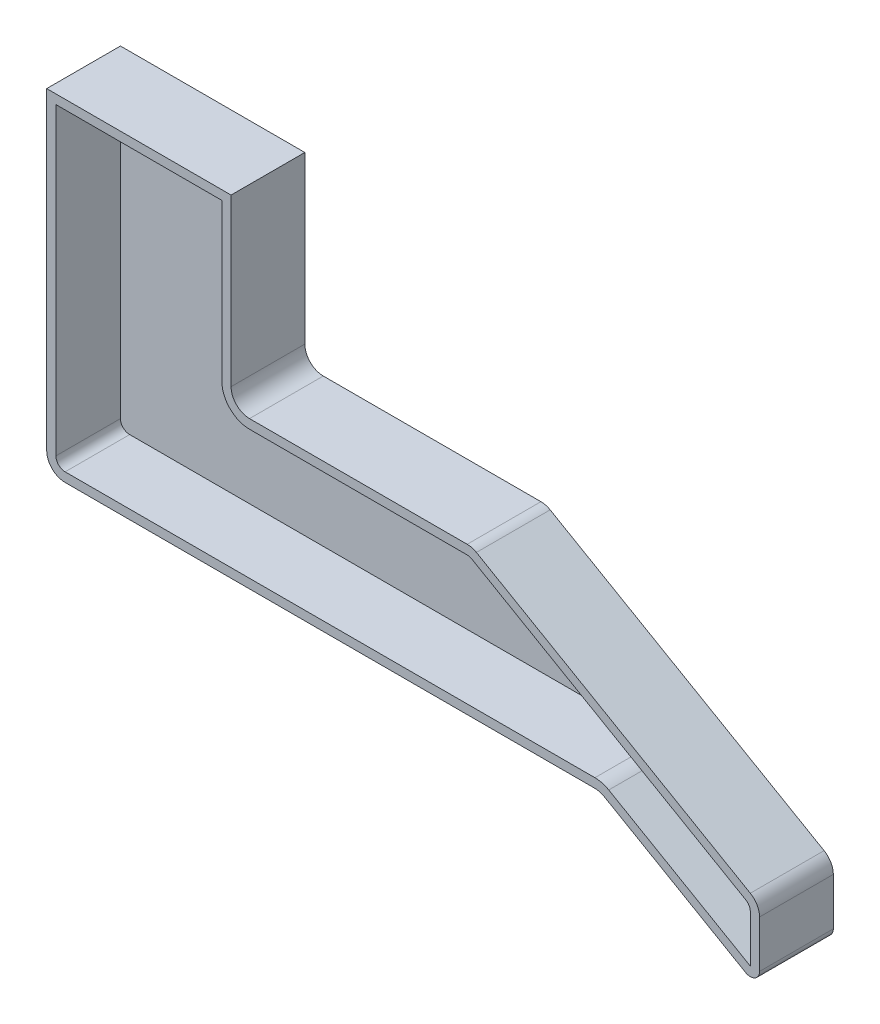
ISO-10303-21;
HEADER;
FILE_DESCRIPTION(('STEP AP214'),'2;1');
FILE_NAME('part.step','',(''),(''),'','','');
FILE_SCHEMA(('AUTOMOTIVE_DESIGN { 1 0 10303 214 1 1 1 1 }'));
ENDSEC;
DATA;
#1=APPLICATION_CONTEXT('core data for automotive mechanical design processes');
#2=APPLICATION_PROTOCOL_DEFINITION('international standard','automotive_design',2000,#1);
#3=PRODUCT_CONTEXT('',#1,'mechanical');
#4=PRODUCT('Part','Part','',(#3));
#5=PRODUCT_RELATED_PRODUCT_CATEGORY('part','',(#4));
#6=PRODUCT_DEFINITION_FORMATION('','',#4);
#7=PRODUCT_DEFINITION_CONTEXT('part definition',#1,'design');
#8=PRODUCT_DEFINITION('design','',#6,#7);
#9=PRODUCT_DEFINITION_SHAPE('','',#8);
#10=(LENGTH_UNIT() NAMED_UNIT(*) SI_UNIT(.MILLI.,.METRE.));
#11=(NAMED_UNIT(*) PLANE_ANGLE_UNIT() SI_UNIT($,.RADIAN.));
#12=(NAMED_UNIT(*) SI_UNIT($,.STERADIAN.) SOLID_ANGLE_UNIT());
#13=UNCERTAINTY_MEASURE_WITH_UNIT(LENGTH_MEASURE(1.E-05),#10,'distance_accuracy_value','');
#14=(GEOMETRIC_REPRESENTATION_CONTEXT(3) GLOBAL_UNCERTAINTY_ASSIGNED_CONTEXT((#13)) GLOBAL_UNIT_ASSIGNED_CONTEXT((#10,
#11,#12)) REPRESENTATION_CONTEXT('',''));
#15=CARTESIAN_POINT('',(0.,0.,0.));
#16=DIRECTION('',(0.,0.,1.));
#17=DIRECTION('',(1.,0.,0.));
#18=AXIS2_PLACEMENT_3D('',#15,#16,#17);
#19=CARTESIAN_POINT('',(0.,-231.820824471345,20.));
#20=DIRECTION('',(1.,0.,0.));
#21=DIRECTION('',(0.,1.,0.));
#22=AXIS2_PLACEMENT_3D('',#19,#20,#21);
#23=PLANE('',#22);
#24=DIRECTION('',(0.,-1.,0.));
#25=VECTOR('',#24,1.);
#26=CARTESIAN_POINT('',(0.,-231.820824471345,0.));
#27=LINE('',#26,#25);
#28=CARTESIAN_POINT('',(0.,0.,0.));
#29=VERTEX_POINT('',#28);
#30=CARTESIAN_POINT('',(0.,-85.,0.));
#31=VERTEX_POINT('',#30);
#32=EDGE_CURVE('E177',#29,#31,#27,.T.);
#33=ORIENTED_EDGE('',*,*,#32,.T.);
#34=DIRECTION('',(0.,0.,-1.));
#35=VECTOR('',#34,1.);
#36=CARTESIAN_POINT('',(0.,-85.,20.));
#37=LINE('',#36,#35);
#38=CARTESIAN_POINT('',(0.,-85.,20.));
#39=VERTEX_POINT('',#38);
#40=EDGE_CURVE('E11',#39,#31,#37,.T.);
#41=ORIENTED_EDGE('',*,*,#40,.F.);
#42=DIRECTION('',(0.,-1.,0.));
#43=VECTOR('',#42,1.);
#44=CARTESIAN_POINT('',(0.,-231.820824471345,20.));
#45=LINE('',#44,#43);
#46=CARTESIAN_POINT('',(0.,0.,20.));
#47=VERTEX_POINT('',#46);
#48=EDGE_CURVE('E212',#47,#39,#45,.T.);
#49=ORIENTED_EDGE('',*,*,#48,.F.);
#50=DIRECTION('',(0.,0.,-1.));
#51=VECTOR('',#50,1.);
#52=CARTESIAN_POINT('',(0.,0.,20.));
#53=LINE('',#52,#51);
#54=EDGE_CURVE('E55',#47,#29,#53,.T.);
#55=ORIENTED_EDGE('',*,*,#54,.T.);
#56=EDGE_LOOP('',(#33,#41,#49,#55));
#57=FACE_BOUND('',#56,.T.);
#58=ADVANCED_FACE('F32',(#57),#23,.F.);
#59=CARTESIAN_POINT('',(5.00000000000001,-85.,20.));
#60=DIRECTION('',(0.,0.,-1.));
#61=DIRECTION('',(-1.,0.,0.));
#62=AXIS2_PLACEMENT_3D('',#59,#60,#61);
#63=CYLINDRICAL_SURFACE('',#62,5.);
#64=CARTESIAN_POINT('',(5.00000000000001,-85.,0.));
#65=DIRECTION('',(0.,0.,1.));
#66=DIRECTION('',(1.,0.,0.));
#67=AXIS2_PLACEMENT_3D('',#64,#65,#66);
#68=CIRCLE('',#67,5.);
#69=CARTESIAN_POINT('',(5.00000000000002,-90.,0.));
#70=VERTEX_POINT('',#69);
#71=EDGE_CURVE('E179',#31,#70,#68,.T.);
#72=ORIENTED_EDGE('',*,*,#71,.T.);
#73=DIRECTION('',(0.,0.,-1.));
#74=VECTOR('',#73,1.);
#75=CARTESIAN_POINT('',(5.00000000000002,-90.,20.));
#76=LINE('',#75,#74);
#77=CARTESIAN_POINT('',(5.00000000000002,-90.,20.));
#78=VERTEX_POINT('',#77);
#79=EDGE_CURVE('E39',#78,#70,#76,.T.);
#80=ORIENTED_EDGE('',*,*,#79,.F.);
#81=CARTESIAN_POINT('',(5.00000000000001,-85.,20.));
#82=DIRECTION('',(0.,0.,1.));
#83=DIRECTION('',(1.,0.,0.));
#84=AXIS2_PLACEMENT_3D('',#81,#82,#83);
#85=CIRCLE('',#84,5.);
#86=EDGE_CURVE('E112',#39,#78,#85,.T.);
#87=ORIENTED_EDGE('',*,*,#86,.F.);
#88=ORIENTED_EDGE('',*,*,#40,.T.);
#89=EDGE_LOOP('',(#72,#80,#87,#88));
#90=FACE_BOUND('',#89,.T.);
#91=ADVANCED_FACE('F280',(#90),#63,.T.);
#92=CARTESIAN_POINT('',(97.1327483626984,-90.,20.));
#93=DIRECTION('',(0.,1.,0.));
#94=DIRECTION('',(0.,0.,1.));
#95=AXIS2_PLACEMENT_3D('',#92,#93,#94);
#96=PLANE('',#95);
#97=DIRECTION('',(1.,0.,0.));
#98=VECTOR('',#97,1.);
#99=CARTESIAN_POINT('',(97.1327483626984,-90.,0.));
#100=LINE('',#99,#98);
#101=CARTESIAN_POINT('',(148.660254037844,-90.,0.));
#102=VERTEX_POINT('',#101);
#103=EDGE_CURVE('E182',#70,#102,#100,.T.);
#104=ORIENTED_EDGE('',*,*,#103,.T.);
#105=DIRECTION('',(0.,0.,-1.));
#106=VECTOR('',#105,1.);
#107=CARTESIAN_POINT('',(148.660254037844,-90.,20.));
#108=LINE('',#107,#106);
#109=CARTESIAN_POINT('',(148.660254037844,-90.,20.));
#110=VERTEX_POINT('',#109);
#111=EDGE_CURVE('E232',#110,#102,#108,.T.);
#112=ORIENTED_EDGE('',*,*,#111,.F.);
#113=DIRECTION('',(1.,0.,0.));
#114=VECTOR('',#113,1.);
#115=CARTESIAN_POINT('',(97.1327483626984,-90.,20.));
#116=LINE('',#115,#114);
#117=EDGE_CURVE('E240',#78,#110,#116,.T.);
#118=ORIENTED_EDGE('',*,*,#117,.F.);
#119=ORIENTED_EDGE('',*,*,#79,.T.);
#120=EDGE_LOOP('',(#104,#112,#118,#119));
#121=FACE_BOUND('',#120,.T.);
#122=ADVANCED_FACE('F238',(#121),#96,.F.);
#123=CARTESIAN_POINT('',(148.660254037844,-95.,20.));
#124=DIRECTION('',(0.,0.,-1.));
#125=DIRECTION('',(-1.,0.,0.));
#126=AXIS2_PLACEMENT_3D('',#123,#124,#125);
#127=CYLINDRICAL_SURFACE('',#126,4.99999999999999);
#128=CARTESIAN_POINT('',(148.660254037844,-95.,0.));
#129=DIRECTION('',(0.,0.,1.));
#130=DIRECTION('',(1.,0.,0.));
#131=AXIS2_PLACEMENT_3D('',#128,#129,#130);
#132=CIRCLE('',#131,4.99999999999999);
#133=CARTESIAN_POINT('',(151.160254037844,-90.6698729810778,0.));
#134=VERTEX_POINT('',#133);
#135=EDGE_CURVE('E184',#102,#134,#132,.F.);
#136=ORIENTED_EDGE('',*,*,#135,.T.);
#137=DIRECTION('',(0.,0.,-1.));
#138=VECTOR('',#137,1.);
#139=CARTESIAN_POINT('',(151.160254037844,-90.6698729810778,20.));
#140=LINE('',#139,#138);
#141=CARTESIAN_POINT('',(151.160254037844,-90.6698729810778,20.));
#142=VERTEX_POINT('',#141);
#143=EDGE_CURVE('E229',#142,#134,#140,.T.);
#144=ORIENTED_EDGE('',*,*,#143,.F.);
#145=CARTESIAN_POINT('',(148.660254037844,-95.,20.));
#146=DIRECTION('',(0.,0.,1.));
#147=DIRECTION('',(1.,0.,0.));
#148=AXIS2_PLACEMENT_3D('',#145,#146,#147);
#149=CIRCLE('',#148,4.99999999999999);
#150=EDGE_CURVE('E257',#110,#142,#149,.F.);
#151=ORIENTED_EDGE('',*,*,#150,.F.);
#152=ORIENTED_EDGE('',*,*,#111,.T.);
#153=EDGE_LOOP('',(#136,#144,#151,#152));
#154=FACE_BOUND('',#153,.T.);
#155=ADVANCED_FACE('F248',(#154),#127,.F.);
#156=CARTESIAN_POINT('',(171.759779660943,-102.563014644752,20.));
#157=DIRECTION('',(0.500000000000001,0.866025403784438,0.));
#158=DIRECTION('',(-0.866025403784438,0.500000000000001,0.));
#159=AXIS2_PLACEMENT_3D('',#156,#157,#158);
#160=PLANE('',#159);
#161=DIRECTION('',(0.866025403784438,-0.500000000000001,0.));
#162=VECTOR('',#161,1.);
#163=CARTESIAN_POINT('',(171.759779660943,-102.563014644752,0.));
#164=LINE('',#163,#162);
#165=CARTESIAN_POINT('',(189.551270189222,-112.834936490539,0.));
#166=VERTEX_POINT('',#165);
#167=EDGE_CURVE('E186',#134,#166,#164,.T.);
#168=ORIENTED_EDGE('',*,*,#167,.T.);
#169=DIRECTION('',(0.,0.,-1.));
#170=VECTOR('',#169,1.);
#171=CARTESIAN_POINT('',(189.551270189222,-112.834936490539,20.));
#172=LINE('',#171,#170);
#173=CARTESIAN_POINT('',(189.551270189222,-112.834936490539,20.));
#174=VERTEX_POINT('',#173);
#175=EDGE_CURVE('E226',#174,#166,#172,.T.);
#176=ORIENTED_EDGE('',*,*,#175,.F.);
#177=DIRECTION('',(0.866025403784438,-0.500000000000001,0.));
#178=VECTOR('',#177,1.);
#179=CARTESIAN_POINT('',(171.759779660943,-102.563014644752,20.));
#180=LINE('',#179,#178);
#181=EDGE_CURVE('E254',#142,#174,#180,.T.);
#182=ORIENTED_EDGE('',*,*,#181,.F.);
#183=ORIENTED_EDGE('',*,*,#143,.T.);
#184=EDGE_LOOP('',(#168,#176,#182,#183));
#185=FACE_BOUND('',#184,.T.);
#186=ADVANCED_FACE('F252',(#185),#160,.F.);
#187=CARTESIAN_POINT('',(190.801270189222,-110.669872981078,20.));
#188=DIRECTION('',(0.,0.,-1.));
#189=DIRECTION('',(-1.,0.,0.));
#190=AXIS2_PLACEMENT_3D('',#187,#188,#189);
#191=CYLINDRICAL_SURFACE('',#190,2.49999999999998);
#192=CARTESIAN_POINT('',(190.801270189222,-110.669872981078,0.));
#193=DIRECTION('',(0.,0.,1.));
#194=DIRECTION('',(1.,0.,0.));
#195=AXIS2_PLACEMENT_3D('',#192,#193,#194);
#196=CIRCLE('',#195,2.49999999999998);
#197=CARTESIAN_POINT('',(193.301270189222,-110.669872981078,0.));
#198=VERTEX_POINT('',#197);
#199=EDGE_CURVE('E188',#166,#198,#196,.T.);
#200=ORIENTED_EDGE('',*,*,#199,.T.);
#201=DIRECTION('',(0.,0.,-1.));
#202=VECTOR('',#201,1.);
#203=CARTESIAN_POINT('',(193.301270189222,-110.669872981078,20.));
#204=LINE('',#203,#202);
#205=CARTESIAN_POINT('',(193.301270189222,-110.669872981078,20.));
#206=VERTEX_POINT('',#205);
#207=EDGE_CURVE('E224',#206,#198,#204,.T.);
#208=ORIENTED_EDGE('',*,*,#207,.F.);
#209=CARTESIAN_POINT('',(190.801270189222,-110.669872981078,20.));
#210=DIRECTION('',(0.,0.,1.));
#211=DIRECTION('',(1.,0.,0.));
#212=AXIS2_PLACEMENT_3D('',#209,#210,#211);
#213=CIRCLE('',#212,2.49999999999998);
#214=EDGE_CURVE('E256',#174,#206,#213,.T.);
#215=ORIENTED_EDGE('',*,*,#214,.F.);
#216=ORIENTED_EDGE('',*,*,#175,.T.);
#217=EDGE_LOOP('',(#200,#208,#215,#216));
#218=FACE_BOUND('',#217,.T.);
#219=ADVANCED_FACE('F292',(#218),#191,.T.);
#220=CARTESIAN_POINT('',(193.301270189222,-231.820824471345,20.));
#221=DIRECTION('',(1.,0.,0.));
#222=DIRECTION('',(0.,1.,0.));
#223=AXIS2_PLACEMENT_3D('',#220,#221,#222);
#224=PLANE('',#223);
#225=DIRECTION('',(0.,-1.,0.));
#226=VECTOR('',#225,1.);
#227=CARTESIAN_POINT('',(193.301270189222,-231.820824471345,0.));
#228=LINE('',#227,#226);
#229=CARTESIAN_POINT('',(193.301270189222,-97.8867513459482,0.));
#230=VERTEX_POINT('',#229);
#231=EDGE_CURVE('E191',#230,#198,#228,.T.);
#232=ORIENTED_EDGE('',*,*,#231,.F.);
#233=DIRECTION('',(0.,0.,-1.));
#234=VECTOR('',#233,1.);
#235=CARTESIAN_POINT('',(193.301270189222,-97.8867513459482,20.));
#236=LINE('',#235,#234);
#237=CARTESIAN_POINT('',(193.301270189222,-97.8867513459482,20.));
#238=VERTEX_POINT('',#237);
#239=EDGE_CURVE('E222',#238,#230,#236,.T.);
#240=ORIENTED_EDGE('',*,*,#239,.F.);
#241=DIRECTION('',(0.,-1.,0.));
#242=VECTOR('',#241,1.);
#243=CARTESIAN_POINT('',(193.301270189222,-231.820824471345,20.));
#244=LINE('',#243,#242);
#245=EDGE_CURVE('E259',#238,#206,#244,.T.);
#246=ORIENTED_EDGE('',*,*,#245,.T.);
#247=ORIENTED_EDGE('',*,*,#207,.T.);
#248=EDGE_LOOP('',(#232,#240,#246,#247));
#249=FACE_BOUND('',#248,.T.);
#250=ADVANCED_FACE('F295',(#249),#224,.T.);
#251=CARTESIAN_POINT('',(188.301270189222,-97.8867513459482,20.));
#252=DIRECTION('',(0.,0.,-1.));
#253=DIRECTION('',(-1.,0.,0.));
#254=AXIS2_PLACEMENT_3D('',#251,#252,#253);
#255=CYLINDRICAL_SURFACE('',#254,4.99999999999999);
#256=CARTESIAN_POINT('',(188.301270189222,-97.8867513459482,0.));
#257=DIRECTION('',(0.,0.,1.));
#258=DIRECTION('',(1.,0.,0.));
#259=AXIS2_PLACEMENT_3D('',#256,#257,#258);
#260=CIRCLE('',#259,4.99999999999999);
#261=CARTESIAN_POINT('',(190.801270189222,-93.556624327026,0.));
#262=VERTEX_POINT('',#261);
#263=EDGE_CURVE('E194',#262,#230,#260,.F.);
#264=ORIENTED_EDGE('',*,*,#263,.F.);
#265=DIRECTION('',(0.,0.,-1.));
#266=VECTOR('',#265,1.);
#267=CARTESIAN_POINT('',(190.801270189222,-93.556624327026,20.));
#268=LINE('',#267,#266);
#269=CARTESIAN_POINT('',(190.801270189222,-93.556624327026,20.));
#270=VERTEX_POINT('',#269);
#271=EDGE_CURVE('E220',#270,#262,#268,.T.);
#272=ORIENTED_EDGE('',*,*,#271,.F.);
#273=CARTESIAN_POINT('',(188.301270189222,-97.8867513459482,20.));
#274=DIRECTION('',(0.,0.,1.));
#275=DIRECTION('',(1.,0.,0.));
#276=AXIS2_PLACEMENT_3D('',#273,#274,#275);
#277=CIRCLE('',#276,4.99999999999999);
#278=EDGE_CURVE('E266',#270,#238,#277,.F.);
#279=ORIENTED_EDGE('',*,*,#278,.T.);
#280=ORIENTED_EDGE('',*,*,#239,.T.);
#281=EDGE_LOOP('',(#264,#272,#279,#280));
#282=FACE_BOUND('',#281,.T.);
#283=ADVANCED_FACE('F299',(#282),#255,.T.);
#284=CARTESIAN_POINT('',(180.420033698788,-87.5630146447526,20.));
#285=DIRECTION('',(-0.500000000000002,-0.866025403784438,0.));
#286=DIRECTION('',(0.866025403784438,-0.500000000000002,0.));
#287=AXIS2_PLACEMENT_3D('',#284,#285,#286);
#288=PLANE('',#287);
#289=DIRECTION('',(-0.866025403784438,0.500000000000002,0.));
#290=VECTOR('',#289,1.);
#291=CARTESIAN_POINT('',(180.420033698788,-87.5630146447526,0.));
#292=LINE('',#291,#290);
#293=CARTESIAN_POINT('',(116.519237886467,-50.6698729810778,0.));
#294=VERTEX_POINT('',#293);
#295=EDGE_CURVE('E197',#262,#294,#292,.T.);
#296=ORIENTED_EDGE('',*,*,#295,.T.);
#297=DIRECTION('',(0.,0.,-1.));
#298=VECTOR('',#297,1.);
#299=CARTESIAN_POINT('',(116.519237886467,-50.6698729810778,20.));
#300=LINE('',#299,#298);
#301=CARTESIAN_POINT('',(116.519237886467,-50.6698729810778,20.));
#302=VERTEX_POINT('',#301);
#303=EDGE_CURVE('E218',#302,#294,#300,.T.);
#304=ORIENTED_EDGE('',*,*,#303,.F.);
#305=DIRECTION('',(-0.866025403784438,0.500000000000002,0.));
#306=VECTOR('',#305,1.);
#307=CARTESIAN_POINT('',(180.420033698788,-87.5630146447526,20.));
#308=LINE('',#307,#306);
#309=EDGE_CURVE('E269',#270,#302,#308,.T.);
#310=ORIENTED_EDGE('',*,*,#309,.F.);
#311=ORIENTED_EDGE('',*,*,#271,.T.);
#312=EDGE_LOOP('',(#296,#304,#310,#311));
#313=FACE_BOUND('',#312,.T.);
#314=ADVANCED_FACE('F303',(#313),#288,.F.);
#315=CARTESIAN_POINT('',(114.019237886467,-55.,20.));
#316=DIRECTION('',(0.,0.,-1.));
#317=DIRECTION('',(-1.,0.,0.));
#318=AXIS2_PLACEMENT_3D('',#315,#316,#317);
#319=CYLINDRICAL_SURFACE('',#318,4.99999999999999);
#320=CARTESIAN_POINT('',(114.019237886467,-55.,0.));
#321=DIRECTION('',(0.,0.,1.));
#322=DIRECTION('',(1.,0.,0.));
#323=AXIS2_PLACEMENT_3D('',#320,#321,#322);
#324=CIRCLE('',#323,4.99999999999999);
#325=CARTESIAN_POINT('',(114.019237886467,-50.,0.));
#326=VERTEX_POINT('',#325);
#327=EDGE_CURVE('E200',#326,#294,#324,.F.);
#328=ORIENTED_EDGE('',*,*,#327,.F.);
#329=DIRECTION('',(0.,0.,-1.));
#330=VECTOR('',#329,1.);
#331=CARTESIAN_POINT('',(114.019237886467,-50.,20.));
#332=LINE('',#331,#330);
#333=CARTESIAN_POINT('',(114.019237886467,-50.,20.));
#334=VERTEX_POINT('',#333);
#335=EDGE_CURVE('E216',#334,#326,#332,.T.);
#336=ORIENTED_EDGE('',*,*,#335,.F.);
#337=CARTESIAN_POINT('',(114.019237886467,-55.,20.));
#338=DIRECTION('',(0.,0.,1.));
#339=DIRECTION('',(1.,0.,0.));
#340=AXIS2_PLACEMENT_3D('',#337,#338,#339);
#341=CIRCLE('',#340,4.99999999999999);
#342=EDGE_CURVE('E271',#334,#302,#341,.F.);
#343=ORIENTED_EDGE('',*,*,#342,.T.);
#344=ORIENTED_EDGE('',*,*,#303,.T.);
#345=EDGE_LOOP('',(#328,#336,#343,#344));
#346=FACE_BOUND('',#345,.T.);
#347=ADVANCED_FACE('F307',(#346),#319,.T.);
#348=CARTESIAN_POINT('',(97.1327483626983,-50.,20.));
#349=DIRECTION('',(0.,1.,0.));
#350=DIRECTION('',(-1.,0.,0.));
#351=AXIS2_PLACEMENT_3D('',#348,#349,#350);
#352=PLANE('',#351);
#353=DIRECTION('',(1.,0.,0.));
#354=VECTOR('',#353,1.);
#355=CARTESIAN_POINT('',(97.1327483626983,-50.,0.));
#356=LINE('',#355,#354);
#357=CARTESIAN_POINT('',(55.,-50.,0.));
#358=VERTEX_POINT('',#357);
#359=EDGE_CURVE('E203',#358,#326,#356,.T.);
#360=ORIENTED_EDGE('',*,*,#359,.F.);
#361=DIRECTION('',(0.,0.,-1.));
#362=VECTOR('',#361,1.);
#363=CARTESIAN_POINT('',(55.,-50.,20.));
#364=LINE('',#363,#362);
#365=CARTESIAN_POINT('',(55.,-50.,20.));
#366=VERTEX_POINT('',#365);
#367=EDGE_CURVE('E158',#366,#358,#364,.T.);
#368=ORIENTED_EDGE('',*,*,#367,.F.);
#369=DIRECTION('',(1.,0.,0.));
#370=VECTOR('',#369,1.);
#371=CARTESIAN_POINT('',(97.1327483626983,-50.,20.));
#372=LINE('',#371,#370);
#373=EDGE_CURVE('E169',#366,#334,#372,.T.);
#374=ORIENTED_EDGE('',*,*,#373,.T.);
#375=ORIENTED_EDGE('',*,*,#335,.T.);
#376=EDGE_LOOP('',(#360,#368,#374,#375));
#377=FACE_BOUND('',#376,.T.);
#378=ADVANCED_FACE('F275',(#377),#352,.T.);
#379=CARTESIAN_POINT('',(55.,-45.,20.));
#380=DIRECTION('',(0.,0.,-1.));
#381=DIRECTION('',(-1.,0.,0.));
#382=AXIS2_PLACEMENT_3D('',#379,#380,#381);
#383=CYLINDRICAL_SURFACE('',#382,5.);
#384=CARTESIAN_POINT('',(55.,-45.,0.));
#385=DIRECTION('',(0.,0.,1.));
#386=DIRECTION('',(1.,0.,0.));
#387=AXIS2_PLACEMENT_3D('',#384,#385,#386);
#388=CIRCLE('',#387,5.);
#389=CARTESIAN_POINT('',(50.,-45.,0.));
#390=VERTEX_POINT('',#389);
#391=EDGE_CURVE('E153',#390,#358,#388,.T.);
#392=ORIENTED_EDGE('',*,*,#391,.F.);
#393=DIRECTION('',(0.,0.,-1.));
#394=VECTOR('',#393,1.);
#395=CARTESIAN_POINT('',(50.,-45.,20.));
#396=LINE('',#395,#394);
#397=CARTESIAN_POINT('',(50.,-45.,20.));
#398=VERTEX_POINT('',#397);
#399=EDGE_CURVE('E148',#398,#390,#396,.T.);
#400=ORIENTED_EDGE('',*,*,#399,.F.);
#401=CARTESIAN_POINT('',(55.,-45.,20.));
#402=DIRECTION('',(0.,0.,1.));
#403=DIRECTION('',(1.,0.,0.));
#404=AXIS2_PLACEMENT_3D('',#401,#402,#403);
#405=CIRCLE('',#404,5.);
#406=EDGE_CURVE('E151',#398,#366,#405,.T.);
#407=ORIENTED_EDGE('',*,*,#406,.T.);
#408=ORIENTED_EDGE('',*,*,#367,.T.);
#409=EDGE_LOOP('',(#392,#400,#407,#408));
#410=FACE_BOUND('',#409,.T.);
#411=ADVANCED_FACE('F150',(#410),#383,.F.);
#412=CARTESIAN_POINT('',(50.,-231.820824471345,20.));
#413=DIRECTION('',(1.,0.,0.));
#414=DIRECTION('',(0.,0.,-1.));
#415=AXIS2_PLACEMENT_3D('',#412,#413,#414);
#416=PLANE('',#415);
#417=DIRECTION('',(0.,-1.,0.));
#418=VECTOR('',#417,1.);
#419=CARTESIAN_POINT('',(50.,-231.820824471345,0.));
#420=LINE('',#419,#418);
#421=CARTESIAN_POINT('',(50.,2.06698656436839E-13,0.));
#422=VERTEX_POINT('',#421);
#423=EDGE_CURVE('E207',#422,#390,#420,.T.);
#424=ORIENTED_EDGE('',*,*,#423,.F.);
#425=DIRECTION('',(0.,0.,-1.));
#426=VECTOR('',#425,1.);
#427=CARTESIAN_POINT('',(50.,2.06698656436839E-13,20.));
#428=LINE('',#427,#426);
#429=CARTESIAN_POINT('',(50.,2.06698656436839E-13,20.));
#430=VERTEX_POINT('',#429);
#431=EDGE_CURVE('E159',#430,#422,#428,.T.);
#432=ORIENTED_EDGE('',*,*,#431,.F.);
#433=DIRECTION('',(0.,-1.,0.));
#434=VECTOR('',#433,1.);
#435=CARTESIAN_POINT('',(50.,-231.820824471345,20.));
#436=LINE('',#435,#434);
#437=EDGE_CURVE('E166',#430,#398,#436,.T.);
#438=ORIENTED_EDGE('',*,*,#437,.T.);
#439=ORIENTED_EDGE('',*,*,#399,.T.);
#440=EDGE_LOOP('',(#424,#432,#438,#439));
#441=FACE_BOUND('',#440,.T.);
#442=ADVANCED_FACE('F171',(#441),#416,.T.);
#443=CARTESIAN_POINT('',(97.1327483626975,3.88578058618805E-13,20.));
#444=DIRECTION('',(0.,1.,0.));
#445=DIRECTION('',(-1.,0.,0.));
#446=AXIS2_PLACEMENT_3D('',#443,#444,#445);
#447=PLANE('',#446);
#448=DIRECTION('',(1.,0.,0.));
#449=VECTOR('',#448,1.);
#450=CARTESIAN_POINT('',(97.1327483626975,3.88578058618805E-13,0.));
#451=LINE('',#450,#449);
#452=EDGE_CURVE('E209',#29,#422,#451,.T.);
#453=ORIENTED_EDGE('',*,*,#452,.F.);
#454=ORIENTED_EDGE('',*,*,#54,.F.);
#455=DIRECTION('',(1.,0.,0.));
#456=VECTOR('',#455,1.);
#457=CARTESIAN_POINT('',(97.1327483626975,3.88578058618805E-13,20.));
#458=LINE('',#457,#456);
#459=EDGE_CURVE('E172',#47,#430,#458,.T.);
#460=ORIENTED_EDGE('',*,*,#459,.T.);
#461=ORIENTED_EDGE('',*,*,#431,.T.);
#462=EDGE_LOOP('',(#453,#454,#460,#461));
#463=FACE_BOUND('',#462,.T.);
#464=ADVANCED_FACE('F277',(#463),#447,.T.);
#465=CARTESIAN_POINT('',(97.1327483626984,-231.820824471345,20.));
#466=DIRECTION('',(0.,0.,1.));
#467=DIRECTION('',(1.,0.,0.));
#468=AXIS2_PLACEMENT_3D('',#465,#466,#467);
#469=PLANE('',#468);
#470=DIRECTION('',(0.,-1.,0.));
#471=VECTOR('',#470,1.);
#472=CARTESIAN_POINT('',(2.50000000000003,-231.820824471345,20.));
#473=LINE('',#472,#471);
#474=CARTESIAN_POINT('',(2.5,-2.49999999999998,20.));
#475=VERTEX_POINT('',#474);
#476=CARTESIAN_POINT('',(2.50000000000001,-85.,20.));
#477=VERTEX_POINT('',#476);
#478=EDGE_CURVE('E483',#475,#477,#473,.T.);
#479=ORIENTED_EDGE('',*,*,#478,.F.);
#480=DIRECTION('',(1.,0.,0.));
#481=VECTOR('',#480,1.);
#482=CARTESIAN_POINT('',(97.1327483626975,-2.49999999999961,20.));
#483=LINE('',#482,#481);
#484=CARTESIAN_POINT('',(47.5,-2.4999999999998,20.));
#485=VERTEX_POINT('',#484);
#486=EDGE_CURVE('E417',#475,#485,#483,.T.);
#487=ORIENTED_EDGE('',*,*,#486,.T.);
#488=DIRECTION('',(0.,-1.,0.));
#489=VECTOR('',#488,1.);
#490=CARTESIAN_POINT('',(47.5,-231.820824471345,20.));
#491=LINE('',#490,#489);
#492=CARTESIAN_POINT('',(47.5,-45.,20.));
#493=VERTEX_POINT('',#492);
#494=EDGE_CURVE('E46',#485,#493,#491,.T.);
#495=ORIENTED_EDGE('',*,*,#494,.T.);
#496=CARTESIAN_POINT('',(55.,-45.,20.));
#497=DIRECTION('',(0.,0.,1.));
#498=DIRECTION('',(1.,0.,0.));
#499=AXIS2_PLACEMENT_3D('',#496,#497,#498);
#500=CIRCLE('',#499,7.5);
#501=CARTESIAN_POINT('',(55.,-52.5,20.));
#502=VERTEX_POINT('',#501);
#503=EDGE_CURVE('E513',#493,#502,#500,.T.);
#504=ORIENTED_EDGE('',*,*,#503,.T.);
#505=DIRECTION('',(1.,0.,0.));
#506=VECTOR('',#505,1.);
#507=CARTESIAN_POINT('',(97.1327483626983,-52.5,20.));
#508=LINE('',#507,#506);
#509=CARTESIAN_POINT('',(114.019237886467,-52.5,20.));
#510=VERTEX_POINT('',#509);
#511=EDGE_CURVE('E510',#502,#510,#508,.T.);
#512=ORIENTED_EDGE('',*,*,#511,.T.);
#513=CARTESIAN_POINT('',(114.019237886467,-55.,20.));
#514=DIRECTION('',(0.,0.,1.));
#515=DIRECTION('',(1.,0.,0.));
#516=AXIS2_PLACEMENT_3D('',#513,#514,#515);
#517=CIRCLE('',#516,2.49999999999999);
#518=CARTESIAN_POINT('',(115.269237886467,-52.8349364905389,20.));
#519=VERTEX_POINT('',#518);
#520=EDGE_CURVE('E507',#510,#519,#517,.F.);
#521=ORIENTED_EDGE('',*,*,#520,.T.);
#522=DIRECTION('',(-0.866025403784438,0.500000000000002,0.));
#523=VECTOR('',#522,1.);
#524=CARTESIAN_POINT('',(179.170033698788,-89.7280781542137,20.));
#525=LINE('',#524,#523);
#526=CARTESIAN_POINT('',(189.551270189222,-95.7216878364871,20.));
#527=VERTEX_POINT('',#526);
#528=EDGE_CURVE('E504',#527,#519,#525,.T.);
#529=ORIENTED_EDGE('',*,*,#528,.F.);
#530=CARTESIAN_POINT('',(188.301270189222,-97.8867513459482,20.));
#531=DIRECTION('',(0.,0.,1.));
#532=DIRECTION('',(1.,0.,0.));
#533=AXIS2_PLACEMENT_3D('',#530,#531,#532);
#534=CIRCLE('',#533,2.49999999999999);
#535=CARTESIAN_POINT('',(190.801270189222,-97.8867513459482,20.));
#536=VERTEX_POINT('',#535);
#537=EDGE_CURVE('E501',#527,#536,#534,.F.);
#538=ORIENTED_EDGE('',*,*,#537,.T.);
#539=DIRECTION('',(0.,-1.,0.));
#540=VECTOR('',#539,1.);
#541=CARTESIAN_POINT('',(190.801270189222,-231.820824471345,20.));
#542=LINE('',#541,#540);
#543=CARTESIAN_POINT('',(190.801270189222,-110.669872981078,20.));
#544=VERTEX_POINT('',#543);
#545=EDGE_CURVE('E498',#536,#544,#542,.T.);
#546=ORIENTED_EDGE('',*,*,#545,.T.);
#547=DIRECTION('',(0.866025403784438,-0.500000000000001,0.));
#548=VECTOR('',#547,1.);
#549=CARTESIAN_POINT('',(173.009779660943,-100.397951135291,20.));
#550=LINE('',#549,#548);
#551=CARTESIAN_POINT('',(152.410254037844,-88.5048094716167,20.));
#552=VERTEX_POINT('',#551);
#553=EDGE_CURVE('E495',#552,#544,#550,.T.);
#554=ORIENTED_EDGE('',*,*,#553,.F.);
#555=CARTESIAN_POINT('',(148.660254037844,-95.,20.));
#556=DIRECTION('',(0.,0.,1.));
#557=DIRECTION('',(1.,0.,0.));
#558=AXIS2_PLACEMENT_3D('',#555,#556,#557);
#559=CIRCLE('',#558,7.49999999999999);
#560=CARTESIAN_POINT('',(148.660254037844,-87.5,20.));
#561=VERTEX_POINT('',#560);
#562=EDGE_CURVE('E492',#561,#552,#559,.F.);
#563=ORIENTED_EDGE('',*,*,#562,.F.);
#564=DIRECTION('',(1.,0.,0.));
#565=VECTOR('',#564,1.);
#566=CARTESIAN_POINT('',(97.1327483626984,-87.5,20.));
#567=LINE('',#566,#565);
#568=CARTESIAN_POINT('',(5.00000000000002,-87.5,20.));
#569=VERTEX_POINT('',#568);
#570=EDGE_CURVE('E489',#569,#561,#567,.T.);
#571=ORIENTED_EDGE('',*,*,#570,.F.);
#572=CARTESIAN_POINT('',(5.00000000000001,-85.,20.));
#573=DIRECTION('',(0.,0.,1.));
#574=DIRECTION('',(1.,0.,0.));
#575=AXIS2_PLACEMENT_3D('',#572,#573,#574);
#576=CIRCLE('',#575,2.5);
#577=EDGE_CURVE('E486',#477,#569,#576,.T.);
#578=ORIENTED_EDGE('',*,*,#577,.F.);
#579=EDGE_LOOP('',(#479,#487,#495,#504,#512,#521,#529,#538,#546,#554,#563,#571,#578));
#580=FACE_BOUND('',#579,.T.);
#581=ORIENTED_EDGE('',*,*,#48,.T.);
#582=ORIENTED_EDGE('',*,*,#86,.T.);
#583=ORIENTED_EDGE('',*,*,#117,.T.);
#584=ORIENTED_EDGE('',*,*,#150,.T.);
#585=ORIENTED_EDGE('',*,*,#181,.T.);
#586=ORIENTED_EDGE('',*,*,#214,.T.);
#587=ORIENTED_EDGE('',*,*,#245,.F.);
#588=ORIENTED_EDGE('',*,*,#278,.F.);
#589=ORIENTED_EDGE('',*,*,#309,.T.);
#590=ORIENTED_EDGE('',*,*,#342,.F.);
#591=ORIENTED_EDGE('',*,*,#373,.F.);
#592=ORIENTED_EDGE('',*,*,#406,.F.);
#593=ORIENTED_EDGE('',*,*,#437,.F.);
#594=ORIENTED_EDGE('',*,*,#459,.F.);
#595=EDGE_LOOP('',(#581,#582,#583,#584,#585,#586,#587,#588,#589,#590,#591,#592,#593,#594));
#596=FACE_BOUND('',#595,.T.);
#597=ADVANCED_FACE('F164',(#580,#596),#469,.T.);
#598=CARTESIAN_POINT('',(97.1327483626984,-231.820824471345,0.));
#599=DIRECTION('',(0.,0.,1.));
#600=DIRECTION('',(1.,0.,0.));
#601=AXIS2_PLACEMENT_3D('',#598,#599,#600);
#602=PLANE('',#601);
#603=CARTESIAN_POINT('',(35.,-10.,0.));
#604=DIRECTION('',(0.,0.,1.));
#605=DIRECTION('',(1.,0.,0.));
#606=AXIS2_PLACEMENT_3D('',#603,#604,#605);
#607=CIRCLE('',#606,2.5);
#608=CARTESIAN_POINT('',(37.5,-10.,0.));
#609=VERTEX_POINT('',#608);
#610=EDGE_CURVE('E393',#609,#609,#607,.T.);
#611=ORIENTED_EDGE('',*,*,#610,.T.);
#612=EDGE_LOOP('',(#611));
#613=FACE_BOUND('',#612,.T.);
#614=CARTESIAN_POINT('',(15.,-10.,0.));
#615=DIRECTION('',(0.,0.,1.));
#616=DIRECTION('',(1.,0.,0.));
#617=AXIS2_PLACEMENT_3D('',#614,#615,#616);
#618=CIRCLE('',#617,2.5);
#619=CARTESIAN_POINT('',(17.5,-10.,0.));
#620=VERTEX_POINT('',#619);
#621=EDGE_CURVE('E401',#620,#620,#618,.T.);
#622=ORIENTED_EDGE('',*,*,#621,.T.);
#623=EDGE_LOOP('',(#622));
#624=FACE_BOUND('',#623,.T.);
#625=ORIENTED_EDGE('',*,*,#32,.F.);
#626=ORIENTED_EDGE('',*,*,#452,.T.);
#627=ORIENTED_EDGE('',*,*,#423,.T.);
#628=ORIENTED_EDGE('',*,*,#391,.T.);
#629=ORIENTED_EDGE('',*,*,#359,.T.);
#630=ORIENTED_EDGE('',*,*,#327,.T.);
#631=ORIENTED_EDGE('',*,*,#295,.F.);
#632=ORIENTED_EDGE('',*,*,#263,.T.);
#633=ORIENTED_EDGE('',*,*,#231,.T.);
#634=ORIENTED_EDGE('',*,*,#199,.F.);
#635=ORIENTED_EDGE('',*,*,#167,.F.);
#636=ORIENTED_EDGE('',*,*,#135,.F.);
#637=ORIENTED_EDGE('',*,*,#103,.F.);
#638=ORIENTED_EDGE('',*,*,#71,.F.);
#639=EDGE_LOOP('',(#625,#626,#627,#628,#629,#630,#631,#632,#633,#634,#635,#636,#637,#638));
#640=FACE_BOUND('',#639,.T.);
#641=ADVANCED_FACE('F243',(#613,#624,#640),#602,.F.);
#642=CARTESIAN_POINT('',(2.50000000000003,-231.820824471345,20.));
#643=DIRECTION('',(1.,0.,0.));
#644=DIRECTION('',(0.,1.,0.));
#645=AXIS2_PLACEMENT_3D('',#642,#643,#644);
#646=PLANE('',#645);
#647=DIRECTION('',(0.,-1.,0.));
#648=VECTOR('',#647,1.);
#649=CARTESIAN_POINT('',(2.50000000000003,-231.820824471345,2.5));
#650=LINE('',#649,#648);
#651=CARTESIAN_POINT('',(2.5,-2.49999999999998,2.5));
#652=VERTEX_POINT('',#651);
#653=CARTESIAN_POINT('',(2.50000000000001,-85.,2.5));
#654=VERTEX_POINT('',#653);
#655=EDGE_CURVE('E404',#652,#654,#650,.T.);
#656=ORIENTED_EDGE('',*,*,#655,.F.);
#657=DIRECTION('',(0.,0.,-1.));
#658=VECTOR('',#657,1.);
#659=CARTESIAN_POINT('',(2.5,-2.49999999999998,20.));
#660=LINE('',#659,#658);
#661=EDGE_CURVE('E413',#475,#652,#660,.T.);
#662=ORIENTED_EDGE('',*,*,#661,.F.);
#663=ORIENTED_EDGE('',*,*,#478,.T.);
#664=DIRECTION('',(0.,0.,-1.));
#665=VECTOR('',#664,1.);
#666=CARTESIAN_POINT('',(2.50000000000001,-85.,20.));
#667=LINE('',#666,#665);
#668=EDGE_CURVE('E180',#477,#654,#667,.T.);
#669=ORIENTED_EDGE('',*,*,#668,.T.);
#670=EDGE_LOOP('',(#656,#662,#663,#669));
#671=FACE_BOUND('',#670,.T.);
#672=ADVANCED_FACE('F322',(#671),#646,.T.);
#673=CARTESIAN_POINT('',(5.00000000000001,-85.,20.));
#674=DIRECTION('',(0.,0.,-1.));
#675=DIRECTION('',(-1.,0.,0.));
#676=AXIS2_PLACEMENT_3D('',#673,#674,#675);
#677=CYLINDRICAL_SURFACE('',#676,2.5);
#678=CARTESIAN_POINT('',(5.00000000000001,-85.,2.5));
#679=DIRECTION('',(0.,0.,1.));
#680=DIRECTION('',(1.,0.,0.));
#681=AXIS2_PLACEMENT_3D('',#678,#679,#680);
#682=CIRCLE('',#681,2.5);
#683=CARTESIAN_POINT('',(5.00000000000002,-87.5,2.5));
#684=VERTEX_POINT('',#683);
#685=EDGE_CURVE('E409',#654,#684,#682,.T.);
#686=ORIENTED_EDGE('',*,*,#685,.F.);
#687=ORIENTED_EDGE('',*,*,#668,.F.);
#688=ORIENTED_EDGE('',*,*,#577,.T.);
#689=DIRECTION('',(0.,0.,1.));
#690=VECTOR('',#689,1.);
#691=CARTESIAN_POINT('',(5.00000000000002,-87.5,20.));
#692=LINE('',#691,#690);
#693=EDGE_CURVE('E412',#569,#684,#692,.F.);
#694=ORIENTED_EDGE('',*,*,#693,.T.);
#695=EDGE_LOOP('',(#686,#687,#688,#694));
#696=FACE_BOUND('',#695,.T.);
#697=ADVANCED_FACE('F374',(#696),#677,.F.);
#698=CARTESIAN_POINT('',(97.1327483626984,-87.5,20.));
#699=DIRECTION('',(0.,1.,0.));
#700=DIRECTION('',(0.,0.,1.));
#701=AXIS2_PLACEMENT_3D('',#698,#699,#700);
#702=PLANE('',#701);
#703=DIRECTION('',(1.,0.,0.));
#704=VECTOR('',#703,1.);
#705=CARTESIAN_POINT('',(97.1327483626984,-87.5,2.5));
#706=LINE('',#705,#704);
#707=CARTESIAN_POINT('',(148.660254037844,-87.5,2.5));
#708=VERTEX_POINT('',#707);
#709=EDGE_CURVE('E420',#684,#708,#706,.T.);
#710=ORIENTED_EDGE('',*,*,#709,.F.);
#711=ORIENTED_EDGE('',*,*,#693,.F.);
#712=ORIENTED_EDGE('',*,*,#570,.T.);
#713=DIRECTION('',(0.,0.,-1.));
#714=VECTOR('',#713,1.);
#715=CARTESIAN_POINT('',(148.660254037844,-87.5,20.));
#716=LINE('',#715,#714);
#717=EDGE_CURVE('E423',#561,#708,#716,.T.);
#718=ORIENTED_EDGE('',*,*,#717,.T.);
#719=EDGE_LOOP('',(#710,#711,#712,#718));
#720=FACE_BOUND('',#719,.T.);
#721=ADVANCED_FACE('F370',(#720),#702,.T.);
#722=CARTESIAN_POINT('',(148.660254037844,-95.,20.));
#723=DIRECTION('',(0.,0.,-1.));
#724=DIRECTION('',(-1.,0.,0.));
#725=AXIS2_PLACEMENT_3D('',#722,#723,#724);
#726=CYLINDRICAL_SURFACE('',#725,7.49999999999999);
#727=CARTESIAN_POINT('',(148.660254037844,-95.,2.5));
#728=DIRECTION('',(0.,0.,1.));
#729=DIRECTION('',(1.,0.,0.));
#730=AXIS2_PLACEMENT_3D('',#727,#728,#729);
#731=CIRCLE('',#730,7.49999999999999);
#732=CARTESIAN_POINT('',(152.410254037844,-88.5048094716167,2.5));
#733=VERTEX_POINT('',#732);
#734=EDGE_CURVE('E426',#708,#733,#731,.F.);
#735=ORIENTED_EDGE('',*,*,#734,.F.);
#736=ORIENTED_EDGE('',*,*,#717,.F.);
#737=ORIENTED_EDGE('',*,*,#562,.T.);
#738=DIRECTION('',(0.,0.,1.));
#739=VECTOR('',#738,1.);
#740=CARTESIAN_POINT('',(152.410254037844,-88.5048094716167,20.));
#741=LINE('',#740,#739);
#742=EDGE_CURVE('E429',#552,#733,#741,.F.);
#743=ORIENTED_EDGE('',*,*,#742,.T.);
#744=EDGE_LOOP('',(#735,#736,#737,#743));
#745=FACE_BOUND('',#744,.T.);
#746=ADVANCED_FACE('F366',(#745),#726,.T.);
#747=CARTESIAN_POINT('',(173.009779660943,-100.397951135291,20.));
#748=DIRECTION('',(0.500000000000001,0.866025403784438,0.));
#749=DIRECTION('',(-0.866025403784438,0.500000000000001,0.));
#750=AXIS2_PLACEMENT_3D('',#747,#748,#749);
#751=PLANE('',#750);
#752=DIRECTION('',(0.866025403784438,-0.500000000000001,0.));
#753=VECTOR('',#752,1.);
#754=CARTESIAN_POINT('',(173.009779660943,-100.397951135291,2.5));
#755=LINE('',#754,#753);
#756=CARTESIAN_POINT('',(190.801270189222,-110.669872981078,2.5));
#757=VERTEX_POINT('',#756);
#758=EDGE_CURVE('E432',#733,#757,#755,.T.);
#759=ORIENTED_EDGE('',*,*,#758,.F.);
#760=ORIENTED_EDGE('',*,*,#742,.F.);
#761=ORIENTED_EDGE('',*,*,#553,.T.);
#762=DIRECTION('',(0.,0.,-1.));
#763=VECTOR('',#762,1.);
#764=CARTESIAN_POINT('',(190.801270189222,-110.669872981078,20.));
#765=LINE('',#764,#763);
#766=EDGE_CURVE('E435',#544,#757,#765,.T.);
#767=ORIENTED_EDGE('',*,*,#766,.T.);
#768=EDGE_LOOP('',(#759,#760,#761,#767));
#769=FACE_BOUND('',#768,.T.);
#770=ADVANCED_FACE('F362',(#769),#751,.T.);
#771=CARTESIAN_POINT('',(190.801270189222,-231.820824471345,20.));
#772=DIRECTION('',(1.,0.,0.));
#773=DIRECTION('',(0.,1.,0.));
#774=AXIS2_PLACEMENT_3D('',#771,#772,#773);
#775=PLANE('',#774);
#776=DIRECTION('',(0.,-1.,0.));
#777=VECTOR('',#776,1.);
#778=CARTESIAN_POINT('',(190.801270189222,-231.820824471345,2.5));
#779=LINE('',#778,#777);
#780=CARTESIAN_POINT('',(190.801270189222,-97.8867513459482,2.5));
#781=VERTEX_POINT('',#780);
#782=EDGE_CURVE('E438',#781,#757,#779,.T.);
#783=ORIENTED_EDGE('',*,*,#782,.T.);
#784=ORIENTED_EDGE('',*,*,#766,.F.);
#785=ORIENTED_EDGE('',*,*,#545,.F.);
#786=DIRECTION('',(0.,0.,-1.));
#787=VECTOR('',#786,1.);
#788=CARTESIAN_POINT('',(190.801270189222,-97.8867513459482,20.));
#789=LINE('',#788,#787);
#790=EDGE_CURVE('E441',#536,#781,#789,.T.);
#791=ORIENTED_EDGE('',*,*,#790,.T.);
#792=EDGE_LOOP('',(#783,#784,#785,#791));
#793=FACE_BOUND('',#792,.T.);
#794=ADVANCED_FACE('F358',(#793),#775,.F.);
#795=CARTESIAN_POINT('',(188.301270189222,-97.8867513459482,20.));
#796=DIRECTION('',(0.,0.,-1.));
#797=DIRECTION('',(-1.,0.,0.));
#798=AXIS2_PLACEMENT_3D('',#795,#796,#797);
#799=CYLINDRICAL_SURFACE('',#798,2.49999999999999);
#800=CARTESIAN_POINT('',(188.301270189222,-97.8867513459482,2.5));
#801=DIRECTION('',(0.,0.,1.));
#802=DIRECTION('',(1.,0.,0.));
#803=AXIS2_PLACEMENT_3D('',#800,#801,#802);
#804=CIRCLE('',#803,2.49999999999999);
#805=CARTESIAN_POINT('',(189.551270189222,-95.7216878364871,2.5));
#806=VERTEX_POINT('',#805);
#807=EDGE_CURVE('E444',#806,#781,#804,.F.);
#808=ORIENTED_EDGE('',*,*,#807,.T.);
#809=ORIENTED_EDGE('',*,*,#790,.F.);
#810=ORIENTED_EDGE('',*,*,#537,.F.);
#811=DIRECTION('',(0.,0.,1.));
#812=VECTOR('',#811,1.);
#813=CARTESIAN_POINT('',(189.551270189222,-95.7216878364871,20.));
#814=LINE('',#813,#812);
#815=EDGE_CURVE('E447',#527,#806,#814,.F.);
#816=ORIENTED_EDGE('',*,*,#815,.T.);
#817=EDGE_LOOP('',(#808,#809,#810,#816));
#818=FACE_BOUND('',#817,.T.);
#819=ADVANCED_FACE('F354',(#818),#799,.F.);
#820=CARTESIAN_POINT('',(179.170033698788,-89.7280781542137,20.));
#821=DIRECTION('',(-0.500000000000002,-0.866025403784438,0.));
#822=DIRECTION('',(0.866025403784438,-0.500000000000002,0.));
#823=AXIS2_PLACEMENT_3D('',#820,#821,#822);
#824=PLANE('',#823);
#825=DIRECTION('',(-0.866025403784438,0.500000000000002,0.));
#826=VECTOR('',#825,1.);
#827=CARTESIAN_POINT('',(179.170033698788,-89.7280781542137,2.5));
#828=LINE('',#827,#826);
#829=CARTESIAN_POINT('',(115.269237886467,-52.8349364905389,2.5));
#830=VERTEX_POINT('',#829);
#831=EDGE_CURVE('E450',#806,#830,#828,.T.);
#832=ORIENTED_EDGE('',*,*,#831,.F.);
#833=ORIENTED_EDGE('',*,*,#815,.F.);
#834=ORIENTED_EDGE('',*,*,#528,.T.);
#835=DIRECTION('',(0.,0.,-1.));
#836=VECTOR('',#835,1.);
#837=CARTESIAN_POINT('',(115.269237886467,-52.8349364905389,20.));
#838=LINE('',#837,#836);
#839=EDGE_CURVE('E453',#519,#830,#838,.T.);
#840=ORIENTED_EDGE('',*,*,#839,.T.);
#841=EDGE_LOOP('',(#832,#833,#834,#840));
#842=FACE_BOUND('',#841,.T.);
#843=ADVANCED_FACE('F350',(#842),#824,.T.);
#844=CARTESIAN_POINT('',(114.019237886467,-55.,20.));
#845=DIRECTION('',(0.,0.,-1.));
#846=DIRECTION('',(-1.,0.,0.));
#847=AXIS2_PLACEMENT_3D('',#844,#845,#846);
#848=CYLINDRICAL_SURFACE('',#847,2.49999999999999);
#849=CARTESIAN_POINT('',(114.019237886467,-55.,2.5));
#850=DIRECTION('',(0.,0.,1.));
#851=DIRECTION('',(1.,0.,0.));
#852=AXIS2_PLACEMENT_3D('',#849,#850,#851);
#853=CIRCLE('',#852,2.49999999999999);
#854=CARTESIAN_POINT('',(114.019237886467,-52.5,2.5));
#855=VERTEX_POINT('',#854);
#856=EDGE_CURVE('E456',#855,#830,#853,.F.);
#857=ORIENTED_EDGE('',*,*,#856,.T.);
#858=ORIENTED_EDGE('',*,*,#839,.F.);
#859=ORIENTED_EDGE('',*,*,#520,.F.);
#860=DIRECTION('',(0.,0.,1.));
#861=VECTOR('',#860,1.);
#862=CARTESIAN_POINT('',(114.019237886467,-52.5,20.));
#863=LINE('',#862,#861);
#864=EDGE_CURVE('E459',#510,#855,#863,.F.);
#865=ORIENTED_EDGE('',*,*,#864,.T.);
#866=EDGE_LOOP('',(#857,#858,#859,#865));
#867=FACE_BOUND('',#866,.T.);
#868=ADVANCED_FACE('F346',(#867),#848,.F.);
#869=CARTESIAN_POINT('',(97.1327483626983,-52.5,20.));
#870=DIRECTION('',(0.,1.,0.));
#871=DIRECTION('',(-1.,0.,0.));
#872=AXIS2_PLACEMENT_3D('',#869,#870,#871);
#873=PLANE('',#872);
#874=DIRECTION('',(1.,0.,0.));
#875=VECTOR('',#874,1.);
#876=CARTESIAN_POINT('',(97.1327483626983,-52.5,2.5));
#877=LINE('',#876,#875);
#878=CARTESIAN_POINT('',(55.,-52.5,2.5));
#879=VERTEX_POINT('',#878);
#880=EDGE_CURVE('E462',#879,#855,#877,.T.);
#881=ORIENTED_EDGE('',*,*,#880,.T.);
#882=ORIENTED_EDGE('',*,*,#864,.F.);
#883=ORIENTED_EDGE('',*,*,#511,.F.);
#884=DIRECTION('',(0.,0.,-1.));
#885=VECTOR('',#884,1.);
#886=CARTESIAN_POINT('',(55.,-52.5,20.));
#887=LINE('',#886,#885);
#888=EDGE_CURVE('E465',#502,#879,#887,.T.);
#889=ORIENTED_EDGE('',*,*,#888,.T.);
#890=EDGE_LOOP('',(#881,#882,#883,#889));
#891=FACE_BOUND('',#890,.T.);
#892=ADVANCED_FACE('F342',(#891),#873,.F.);
#893=CARTESIAN_POINT('',(55.,-45.,20.));
#894=DIRECTION('',(0.,0.,-1.));
#895=DIRECTION('',(-1.,0.,0.));
#896=AXIS2_PLACEMENT_3D('',#893,#894,#895);
#897=CYLINDRICAL_SURFACE('',#896,7.5);
#898=CARTESIAN_POINT('',(55.,-45.,2.5));
#899=DIRECTION('',(0.,0.,1.));
#900=DIRECTION('',(1.,0.,0.));
#901=AXIS2_PLACEMENT_3D('',#898,#899,#900);
#902=CIRCLE('',#901,7.5);
#903=CARTESIAN_POINT('',(47.5,-45.,2.5));
#904=VERTEX_POINT('',#903);
#905=EDGE_CURVE('E468',#904,#879,#902,.T.);
#906=ORIENTED_EDGE('',*,*,#905,.T.);
#907=ORIENTED_EDGE('',*,*,#888,.F.);
#908=ORIENTED_EDGE('',*,*,#503,.F.);
#909=DIRECTION('',(0.,0.,-1.));
#910=VECTOR('',#909,1.);
#911=CARTESIAN_POINT('',(47.5,-45.,20.));
#912=LINE('',#911,#910);
#913=EDGE_CURVE('E471',#493,#904,#912,.T.);
#914=ORIENTED_EDGE('',*,*,#913,.T.);
#915=EDGE_LOOP('',(#906,#907,#908,#914));
#916=FACE_BOUND('',#915,.T.);
#917=ADVANCED_FACE('F339',(#916),#897,.T.);
#918=CARTESIAN_POINT('',(47.5,-231.820824471345,20.));
#919=DIRECTION('',(1.,0.,0.));
#920=DIRECTION('',(0.,0.,-1.));
#921=AXIS2_PLACEMENT_3D('',#918,#919,#920);
#922=PLANE('',#921);
#923=DIRECTION('',(0.,-1.,0.));
#924=VECTOR('',#923,1.);
#925=CARTESIAN_POINT('',(47.5,-231.820824471345,2.5));
#926=LINE('',#925,#924);
#927=CARTESIAN_POINT('',(47.5,-2.4999999999998,2.5));
#928=VERTEX_POINT('',#927);
#929=EDGE_CURVE('E474',#928,#904,#926,.T.);
#930=ORIENTED_EDGE('',*,*,#929,.T.);
#931=ORIENTED_EDGE('',*,*,#913,.F.);
#932=ORIENTED_EDGE('',*,*,#494,.F.);
#933=DIRECTION('',(0.,0.,-1.));
#934=VECTOR('',#933,1.);
#935=CARTESIAN_POINT('',(47.5,-2.4999999999998,20.));
#936=LINE('',#935,#934);
#937=EDGE_CURVE('E416',#485,#928,#936,.T.);
#938=ORIENTED_EDGE('',*,*,#937,.T.);
#939=EDGE_LOOP('',(#930,#931,#932,#938));
#940=FACE_BOUND('',#939,.T.);
#941=ADVANCED_FACE('F335',(#940),#922,.F.);
#942=CARTESIAN_POINT('',(97.1327483626975,-2.49999999999961,20.));
#943=DIRECTION('',(0.,1.,0.));
#944=DIRECTION('',(-1.,0.,0.));
#945=AXIS2_PLACEMENT_3D('',#942,#943,#944);
#946=PLANE('',#945);
#947=DIRECTION('',(1.,0.,0.));
#948=VECTOR('',#947,1.);
#949=CARTESIAN_POINT('',(97.1327483626975,-2.49999999999961,2.5));
#950=LINE('',#949,#948);
#951=EDGE_CURVE('E479',#652,#928,#950,.T.);
#952=ORIENTED_EDGE('',*,*,#951,.T.);
#953=ORIENTED_EDGE('',*,*,#937,.F.);
#954=ORIENTED_EDGE('',*,*,#486,.F.);
#955=ORIENTED_EDGE('',*,*,#661,.T.);
#956=EDGE_LOOP('',(#952,#953,#954,#955));
#957=FACE_BOUND('',#956,.T.);
#958=ADVANCED_FACE('F331',(#957),#946,.F.);
#959=CARTESIAN_POINT('',(97.1327483626984,-231.820824471345,2.5));
#960=DIRECTION('',(0.,0.,1.));
#961=DIRECTION('',(1.,0.,0.));
#962=AXIS2_PLACEMENT_3D('',#959,#960,#961);
#963=PLANE('',#962);
#964=CARTESIAN_POINT('',(35.,-10.,2.5));
#965=DIRECTION('',(0.,0.,1.));
#966=DIRECTION('',(1.,0.,0.));
#967=AXIS2_PLACEMENT_3D('',#964,#965,#966);
#968=CIRCLE('',#967,2.5);
#969=CARTESIAN_POINT('',(37.5,-10.,2.5));
#970=VERTEX_POINT('',#969);
#971=EDGE_CURVE('E396',#970,#970,#968,.T.);
#972=ORIENTED_EDGE('',*,*,#971,.F.);
#973=EDGE_LOOP('',(#972));
#974=FACE_BOUND('',#973,.T.);
#975=CARTESIAN_POINT('',(15.,-10.,2.5));
#976=DIRECTION('',(0.,0.,1.));
#977=DIRECTION('',(1.,0.,0.));
#978=AXIS2_PLACEMENT_3D('',#975,#976,#977);
#979=CIRCLE('',#978,2.5);
#980=CARTESIAN_POINT('',(17.5,-10.,2.5));
#981=VERTEX_POINT('',#980);
#982=EDGE_CURVE('E398',#981,#981,#979,.T.);
#983=ORIENTED_EDGE('',*,*,#982,.F.);
#984=EDGE_LOOP('',(#983));
#985=FACE_BOUND('',#984,.T.);
#986=ORIENTED_EDGE('',*,*,#655,.T.);
#987=ORIENTED_EDGE('',*,*,#685,.T.);
#988=ORIENTED_EDGE('',*,*,#709,.T.);
#989=ORIENTED_EDGE('',*,*,#734,.T.);
#990=ORIENTED_EDGE('',*,*,#758,.T.);
#991=ORIENTED_EDGE('',*,*,#782,.F.);
#992=ORIENTED_EDGE('',*,*,#807,.F.);
#993=ORIENTED_EDGE('',*,*,#831,.T.);
#994=ORIENTED_EDGE('',*,*,#856,.F.);
#995=ORIENTED_EDGE('',*,*,#880,.F.);
#996=ORIENTED_EDGE('',*,*,#905,.F.);
#997=ORIENTED_EDGE('',*,*,#929,.F.);
#998=ORIENTED_EDGE('',*,*,#951,.F.);
#999=EDGE_LOOP('',(#986,#987,#988,#989,#990,#991,#992,#993,#994,#995,#996,#997,#998));
#1000=FACE_BOUND('',#999,.T.);
#1001=ADVANCED_FACE('F327',(#974,#985,#1000),#963,.T.);
#1002=CARTESIAN_POINT('',(15.,-10.,0.));
#1003=DIRECTION('',(0.,0.,1.));
#1004=DIRECTION('',(1.,0.,0.));
#1005=AXIS2_PLACEMENT_3D('',#1002,#1003,#1004);
#1006=CYLINDRICAL_SURFACE('',#1005,2.5);
#1007=ORIENTED_EDGE('',*,*,#621,.F.);
#1008=EDGE_LOOP('',(#1007));
#1009=FACE_BOUND('',#1008,.T.);
#1010=ORIENTED_EDGE('',*,*,#982,.T.);
#1011=EDGE_LOOP('',(#1010));
#1012=FACE_BOUND('',#1011,.T.);
#1013=ADVANCED_FACE('F330',(#1009,#1012),#1006,.F.);
#1014=CARTESIAN_POINT('',(35.,-10.,0.));
#1015=DIRECTION('',(0.,0.,1.));
#1016=DIRECTION('',(1.,0.,0.));
#1017=AXIS2_PLACEMENT_3D('',#1014,#1015,#1016);
#1018=CYLINDRICAL_SURFACE('',#1017,2.5);
#1019=ORIENTED_EDGE('',*,*,#610,.F.);
#1020=EDGE_LOOP('',(#1019));
#1021=FACE_BOUND('',#1020,.T.);
#1022=ORIENTED_EDGE('',*,*,#971,.T.);
#1023=EDGE_LOOP('',(#1022));
#1024=FACE_BOUND('',#1023,.T.);
#1025=ADVANCED_FACE('F384',(#1021,#1024),#1018,.F.);
#1026=CLOSED_SHELL('',(#58,#91,#122,#155,#186,#219,#250,#283,#314,#347,#378,#411,#442,#464,#597,
#641,#672,#697,#721,#746,#770,#794,#819,#843,#868,#892,#917,#941,#958,#1001,#1013,#1025));
#1027=MANIFOLD_SOLID_BREP('B2',#1026);
#1028=ADVANCED_BREP_SHAPE_REPRESENTATION('',(#18,#1027),#14);
#1029=SHAPE_DEFINITION_REPRESENTATION(#9,#1028);
ENDSEC;
END-ISO-10303-21;
